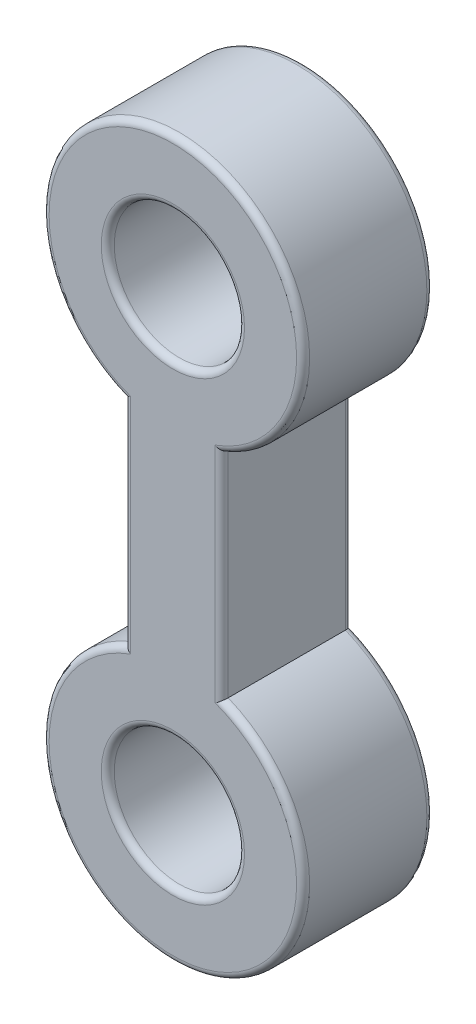
ISO-10303-21;
HEADER;
FILE_DESCRIPTION(('STEP AP214'),'2;1');
FILE_NAME('part.step','',(''),(''),'','','');
FILE_SCHEMA(('AUTOMOTIVE_DESIGN { 1 0 10303 214 1 1 1 1 }'));
ENDSEC;
DATA;
#1=APPLICATION_CONTEXT('core data for automotive mechanical design processes');
#2=APPLICATION_PROTOCOL_DEFINITION('international standard','automotive_design',2000,#1);
#3=PRODUCT_CONTEXT('',#1,'mechanical');
#4=PRODUCT('Part','Part','',(#3));
#5=PRODUCT_RELATED_PRODUCT_CATEGORY('part','',(#4));
#6=PRODUCT_DEFINITION_FORMATION('','',#4);
#7=PRODUCT_DEFINITION_CONTEXT('part definition',#1,'design');
#8=PRODUCT_DEFINITION('design','',#6,#7);
#9=PRODUCT_DEFINITION_SHAPE('','',#8);
#10=(LENGTH_UNIT() NAMED_UNIT(*) SI_UNIT(.MILLI.,.METRE.));
#11=(NAMED_UNIT(*) PLANE_ANGLE_UNIT() SI_UNIT($,.RADIAN.));
#12=(NAMED_UNIT(*) SI_UNIT($,.STERADIAN.) SOLID_ANGLE_UNIT());
#13=UNCERTAINTY_MEASURE_WITH_UNIT(LENGTH_MEASURE(1.E-05),#10,'distance_accuracy_value','');
#14=(GEOMETRIC_REPRESENTATION_CONTEXT(3) GLOBAL_UNCERTAINTY_ASSIGNED_CONTEXT((#13)) GLOBAL_UNIT_ASSIGNED_CONTEXT((#10,
#11,#12)) REPRESENTATION_CONTEXT('',''));
#15=CARTESIAN_POINT('',(0.,0.,0.));
#16=DIRECTION('',(0.,0.,1.));
#17=DIRECTION('',(1.,0.,0.));
#18=AXIS2_PLACEMENT_3D('',#15,#16,#17);
#19=CARTESIAN_POINT('',(0.,0.,10.));
#20=DIRECTION('',(0.,0.,1.));
#21=DIRECTION('',(1.,0.,0.));
#22=AXIS2_PLACEMENT_3D('',#19,#20,#21);
#23=PLANE('',#22);
#24=CARTESIAN_POINT('',(0.,-70.,10.));
#25=DIRECTION('',(0.,0.,1.));
#26=DIRECTION('',(1.,0.,0.));
#27=AXIS2_PLACEMENT_3D('',#24,#25,#26);
#28=CIRCLE('',#27,11.);
#29=CARTESIAN_POINT('',(11.,-70.,10.));
#30=VERTEX_POINT('',#29);
#31=EDGE_CURVE('E11',#30,#30,#28,.F.);
#32=ORIENTED_EDGE('',*,*,#31,.T.);
#33=EDGE_LOOP('',(#32));
#34=FACE_BOUND('',#33,.T.);
#35=CARTESIAN_POINT('',(0.,-70.,10.));
#36=DIRECTION('',(0.,0.,1.));
#37=DIRECTION('',(1.,0.,0.));
#38=AXIS2_PLACEMENT_3D('',#35,#36,#37);
#39=CIRCLE('',#38,19.);
#40=CARTESIAN_POINT('',(-6.49999999999999,-52.1464289286429,10.));
#41=VERTEX_POINT('',#40);
#42=CARTESIAN_POINT('',(6.50000000000001,-52.1464289286429,10.));
#43=VERTEX_POINT('',#42);
#44=EDGE_CURVE('E55',#41,#43,#39,.T.);
#45=ORIENTED_EDGE('',*,*,#44,.T.);
#46=DIRECTION('',(0.,1.,0.));
#47=VECTOR('',#46,1.);
#48=CARTESIAN_POINT('',(6.5,-18.5404962177392,10.));
#49=LINE('',#48,#47);
#50=CARTESIAN_POINT('',(6.5,-17.8535710713571,10.));
#51=VERTEX_POINT('',#50);
#52=EDGE_CURVE('E47',#43,#51,#49,.T.);
#53=ORIENTED_EDGE('',*,*,#52,.T.);
#54=CARTESIAN_POINT('',(0.,0.,10.));
#55=DIRECTION('',(0.,0.,1.));
#56=DIRECTION('',(1.,0.,0.));
#57=AXIS2_PLACEMENT_3D('',#54,#55,#56);
#58=CIRCLE('',#57,19.);
#59=CARTESIAN_POINT('',(-6.5,-17.8535710713571,10.));
#60=VERTEX_POINT('',#59);
#61=EDGE_CURVE('E173',#51,#60,#58,.T.);
#62=ORIENTED_EDGE('',*,*,#61,.T.);
#63=DIRECTION('',(0.,-1.,0.));
#64=VECTOR('',#63,1.);
#65=CARTESIAN_POINT('',(-6.49999999999999,-51.4595037822608,10.));
#66=LINE('',#65,#64);
#67=EDGE_CURVE('E60',#60,#41,#66,.T.);
#68=ORIENTED_EDGE('',*,*,#67,.T.);
#69=EDGE_LOOP('',(#45,#53,#62,#68));
#70=FACE_BOUND('',#69,.T.);
#71=CARTESIAN_POINT('',(0.,0.,10.));
#72=DIRECTION('',(0.,0.,1.));
#73=DIRECTION('',(1.,0.,0.));
#74=AXIS2_PLACEMENT_3D('',#71,#72,#73);
#75=CIRCLE('',#74,11.);
#76=CARTESIAN_POINT('',(11.,0.,10.));
#77=VERTEX_POINT('',#76);
#78=EDGE_CURVE('E170',#77,#77,#75,.F.);
#79=ORIENTED_EDGE('',*,*,#78,.T.);
#80=EDGE_LOOP('',(#79));
#81=FACE_BOUND('',#80,.T.);
#82=ADVANCED_FACE('F33',(#34,#70,#81),#23,.T.);
#83=CARTESIAN_POINT('',(0.,0.,-10.));
#84=DIRECTION('',(0.,0.,1.));
#85=DIRECTION('',(1.,0.,0.));
#86=AXIS2_PLACEMENT_3D('',#83,#84,#85);
#87=PLANE('',#86);
#88=CARTESIAN_POINT('',(0.,-70.,-10.));
#89=DIRECTION('',(0.,0.,1.));
#90=DIRECTION('',(1.,0.,0.));
#91=AXIS2_PLACEMENT_3D('',#88,#89,#90);
#92=CIRCLE('',#91,11.);
#93=CARTESIAN_POINT('',(11.,-70.,-10.));
#94=VERTEX_POINT('',#93);
#95=EDGE_CURVE('E135',#94,#94,#92,.T.);
#96=ORIENTED_EDGE('',*,*,#95,.T.);
#97=EDGE_LOOP('',(#96));
#98=FACE_BOUND('',#97,.T.);
#99=CARTESIAN_POINT('',(0.,0.,-10.));
#100=DIRECTION('',(0.,0.,1.));
#101=DIRECTION('',(1.,0.,0.));
#102=AXIS2_PLACEMENT_3D('',#99,#100,#101);
#103=CIRCLE('',#102,11.);
#104=CARTESIAN_POINT('',(11.,0.,-10.));
#105=VERTEX_POINT('',#104);
#106=EDGE_CURVE('E132',#105,#105,#103,.T.);
#107=ORIENTED_EDGE('',*,*,#106,.T.);
#108=EDGE_LOOP('',(#107));
#109=FACE_BOUND('',#108,.T.);
#110=CARTESIAN_POINT('',(0.,-70.,-10.));
#111=DIRECTION('',(0.,0.,1.));
#112=DIRECTION('',(1.,0.,0.));
#113=AXIS2_PLACEMENT_3D('',#110,#111,#112);
#114=CIRCLE('',#113,19.);
#115=CARTESIAN_POINT('',(6.50000000000001,-52.1464289286429,-10.));
#116=VERTEX_POINT('',#115);
#117=CARTESIAN_POINT('',(-6.49999999999999,-52.1464289286429,-10.));
#118=VERTEX_POINT('',#117);
#119=EDGE_CURVE('E131',#116,#118,#114,.F.);
#120=ORIENTED_EDGE('',*,*,#119,.T.);
#121=DIRECTION('',(0.,-1.,0.));
#122=VECTOR('',#121,1.);
#123=CARTESIAN_POINT('',(-6.5,0.,-10.));
#124=LINE('',#123,#122);
#125=CARTESIAN_POINT('',(-6.5,-17.8535710713571,-10.));
#126=VERTEX_POINT('',#125);
#127=EDGE_CURVE('E110',#118,#126,#124,.F.);
#128=ORIENTED_EDGE('',*,*,#127,.T.);
#129=CARTESIAN_POINT('',(0.,0.,-10.));
#130=DIRECTION('',(0.,0.,1.));
#131=DIRECTION('',(1.,0.,0.));
#132=AXIS2_PLACEMENT_3D('',#129,#130,#131);
#133=CIRCLE('',#132,19.);
#134=CARTESIAN_POINT('',(6.5,-17.8535710713571,-10.));
#135=VERTEX_POINT('',#134);
#136=EDGE_CURVE('E120',#126,#135,#133,.F.);
#137=ORIENTED_EDGE('',*,*,#136,.T.);
#138=DIRECTION('',(0.,1.,0.));
#139=VECTOR('',#138,1.);
#140=CARTESIAN_POINT('',(6.5,0.,-10.));
#141=LINE('',#140,#139);
#142=EDGE_CURVE('E126',#135,#116,#141,.F.);
#143=ORIENTED_EDGE('',*,*,#142,.T.);
#144=EDGE_LOOP('',(#120,#128,#137,#143));
#145=FACE_BOUND('',#144,.T.);
#146=ADVANCED_FACE('F129',(#98,#109,#145),#87,.F.);
#147=CARTESIAN_POINT('',(0.,0.,10.));
#148=DIRECTION('',(0.,0.,-1.));
#149=DIRECTION('',(-1.,0.,0.));
#150=AXIS2_PLACEMENT_3D('',#147,#148,#149);
#151=CYLINDRICAL_SURFACE('',#150,20.);
#152=DIRECTION('',(0.,0.,-1.));
#153=VECTOR('',#152,1.);
#154=CARTESIAN_POINT('',(7.5,-18.5404962177392,10.));
#155=LINE('',#154,#153);
#156=CARTESIAN_POINT('',(7.5,-18.5404962177392,9.));
#157=VERTEX_POINT('',#156);
#158=CARTESIAN_POINT('',(7.5,-18.5404962177392,-9.));
#159=VERTEX_POINT('',#158);
#160=EDGE_CURVE('E326',#157,#159,#155,.T.);
#161=ORIENTED_EDGE('',*,*,#160,.T.);
#162=CARTESIAN_POINT('',(0.,0.,-9.));
#163=DIRECTION('',(0.,0.,1.));
#164=DIRECTION('',(1.,0.,0.));
#165=AXIS2_PLACEMENT_3D('',#162,#163,#164);
#166=CIRCLE('',#165,20.);
#167=CARTESIAN_POINT('',(-7.5,-18.5404962177392,-9.));
#168=VERTEX_POINT('',#167);
#169=EDGE_CURVE('E168',#159,#168,#166,.T.);
#170=ORIENTED_EDGE('',*,*,#169,.T.);
#171=DIRECTION('',(0.,0.,-1.));
#172=VECTOR('',#171,1.);
#173=CARTESIAN_POINT('',(-7.5,-18.5404962177392,10.));
#174=LINE('',#173,#172);
#175=CARTESIAN_POINT('',(-7.5,-18.5404962177392,9.));
#176=VERTEX_POINT('',#175);
#177=EDGE_CURVE('E127',#176,#168,#174,.T.);
#178=ORIENTED_EDGE('',*,*,#177,.F.);
#179=CARTESIAN_POINT('',(0.,0.,9.));
#180=DIRECTION('',(0.,0.,1.));
#181=DIRECTION('',(1.,0.,0.));
#182=AXIS2_PLACEMENT_3D('',#179,#180,#181);
#183=CIRCLE('',#182,20.);
#184=EDGE_CURVE('E166',#176,#157,#183,.F.);
#185=ORIENTED_EDGE('',*,*,#184,.T.);
#186=EDGE_LOOP('',(#161,#170,#178,#185));
#187=FACE_BOUND('',#186,.T.);
#188=ADVANCED_FACE('F265',(#187),#151,.T.);
#189=CARTESIAN_POINT('',(-7.5,-18.5404962177392,10.));
#190=DIRECTION('',(1.,0.,0.));
#191=DIRECTION('',(0.,1.,0.));
#192=AXIS2_PLACEMENT_3D('',#189,#190,#191);
#193=PLANE('',#192);
#194=ORIENTED_EDGE('',*,*,#177,.T.);
#195=DIRECTION('',(0.,-1.,0.));
#196=VECTOR('',#195,1.);
#197=CARTESIAN_POINT('',(-7.5,-18.5404962177392,-9.));
#198=LINE('',#197,#196);
#199=CARTESIAN_POINT('',(-7.49999999999999,-51.4595037822608,-9.));
#200=VERTEX_POINT('',#199);
#201=EDGE_CURVE('E113',#168,#200,#198,.T.);
#202=ORIENTED_EDGE('',*,*,#201,.T.);
#203=DIRECTION('',(0.,0.,-1.));
#204=VECTOR('',#203,1.);
#205=CARTESIAN_POINT('',(-7.49999999999999,-51.4595037822608,10.));
#206=LINE('',#205,#204);
#207=CARTESIAN_POINT('',(-7.49999999999999,-51.4595037822608,9.));
#208=VERTEX_POINT('',#207);
#209=EDGE_CURVE('E328',#208,#200,#206,.T.);
#210=ORIENTED_EDGE('',*,*,#209,.F.);
#211=DIRECTION('',(0.,-1.,0.));
#212=VECTOR('',#211,1.);
#213=CARTESIAN_POINT('',(-7.5,-18.5404962177392,9.));
#214=LINE('',#213,#212);
#215=EDGE_CURVE('E154',#208,#176,#214,.F.);
#216=ORIENTED_EDGE('',*,*,#215,.T.);
#217=EDGE_LOOP('',(#194,#202,#210,#216));
#218=FACE_BOUND('',#217,.T.);
#219=ADVANCED_FACE('F279',(#218),#193,.F.);
#220=CARTESIAN_POINT('',(0.,-70.,10.));
#221=DIRECTION('',(0.,0.,-1.));
#222=DIRECTION('',(-1.,0.,0.));
#223=AXIS2_PLACEMENT_3D('',#220,#221,#222);
#224=CYLINDRICAL_SURFACE('',#223,20.);
#225=ORIENTED_EDGE('',*,*,#209,.T.);
#226=CARTESIAN_POINT('',(0.,-70.,-9.));
#227=DIRECTION('',(0.,0.,1.));
#228=DIRECTION('',(1.,0.,0.));
#229=AXIS2_PLACEMENT_3D('',#226,#227,#228);
#230=CIRCLE('',#229,20.);
#231=CARTESIAN_POINT('',(7.50000000000001,-51.4595037822608,-9.));
#232=VERTEX_POINT('',#231);
#233=EDGE_CURVE('E159',#200,#232,#230,.T.);
#234=ORIENTED_EDGE('',*,*,#233,.T.);
#235=DIRECTION('',(0.,0.,-1.));
#236=VECTOR('',#235,1.);
#237=CARTESIAN_POINT('',(7.50000000000001,-51.4595037822608,10.));
#238=LINE('',#237,#236);
#239=CARTESIAN_POINT('',(7.50000000000001,-51.4595037822608,9.));
#240=VERTEX_POINT('',#239);
#241=EDGE_CURVE('E323',#240,#232,#238,.T.);
#242=ORIENTED_EDGE('',*,*,#241,.F.);
#243=CARTESIAN_POINT('',(0.,-70.,9.));
#244=DIRECTION('',(0.,0.,1.));
#245=DIRECTION('',(1.,0.,0.));
#246=AXIS2_PLACEMENT_3D('',#243,#244,#245);
#247=CIRCLE('',#246,20.);
#248=EDGE_CURVE('E157',#240,#208,#247,.F.);
#249=ORIENTED_EDGE('',*,*,#248,.T.);
#250=EDGE_LOOP('',(#225,#234,#242,#249));
#251=FACE_BOUND('',#250,.T.);
#252=ADVANCED_FACE('F275',(#251),#224,.T.);
#253=CARTESIAN_POINT('',(7.5,-18.5404962177392,10.));
#254=DIRECTION('',(-1.,0.,0.));
#255=DIRECTION('',(0.,-1.,0.));
#256=AXIS2_PLACEMENT_3D('',#253,#254,#255);
#257=PLANE('',#256);
#258=ORIENTED_EDGE('',*,*,#241,.T.);
#259=DIRECTION('',(0.,1.,0.));
#260=VECTOR('',#259,1.);
#261=CARTESIAN_POINT('',(7.5,-18.5404962177392,-9.));
#262=LINE('',#261,#260);
#263=EDGE_CURVE('E164',#232,#159,#262,.T.);
#264=ORIENTED_EDGE('',*,*,#263,.T.);
#265=ORIENTED_EDGE('',*,*,#160,.F.);
#266=DIRECTION('',(0.,1.,0.));
#267=VECTOR('',#266,1.);
#268=CARTESIAN_POINT('',(7.50000000000001,-51.4595037822608,9.));
#269=LINE('',#268,#267);
#270=EDGE_CURVE('E161',#157,#240,#269,.F.);
#271=ORIENTED_EDGE('',*,*,#270,.T.);
#272=EDGE_LOOP('',(#258,#264,#265,#271));
#273=FACE_BOUND('',#272,.T.);
#274=ADVANCED_FACE('F272',(#273),#257,.F.);
#275=CARTESIAN_POINT('',(0.,0.,10.));
#276=DIRECTION('',(0.,0.,-1.));
#277=DIRECTION('',(-1.,0.,0.));
#278=AXIS2_PLACEMENT_3D('',#275,#276,#277);
#279=CYLINDRICAL_SURFACE('',#278,10.);
#280=CARTESIAN_POINT('',(0.,0.,-9.));
#281=DIRECTION('',(0.,0.,1.));
#282=DIRECTION('',(1.,0.,0.));
#283=AXIS2_PLACEMENT_3D('',#280,#281,#282);
#284=CIRCLE('',#283,10.);
#285=CARTESIAN_POINT('',(10.,0.,-9.));
#286=VERTEX_POINT('',#285);
#287=EDGE_CURVE('E151',#286,#286,#284,.F.);
#288=ORIENTED_EDGE('',*,*,#287,.T.);
#289=EDGE_LOOP('',(#288));
#290=FACE_BOUND('',#289,.T.);
#291=CARTESIAN_POINT('',(0.,0.,9.));
#292=DIRECTION('',(0.,0.,1.));
#293=DIRECTION('',(1.,0.,0.));
#294=AXIS2_PLACEMENT_3D('',#291,#292,#293);
#295=CIRCLE('',#294,10.);
#296=CARTESIAN_POINT('',(10.,0.,9.));
#297=VERTEX_POINT('',#296);
#298=EDGE_CURVE('E148',#297,#297,#295,.T.);
#299=ORIENTED_EDGE('',*,*,#298,.T.);
#300=EDGE_LOOP('',(#299));
#301=FACE_BOUND('',#300,.T.);
#302=ADVANCED_FACE('F269',(#290,#301),#279,.F.);
#303=CARTESIAN_POINT('',(0.,-70.,10.));
#304=DIRECTION('',(0.,0.,-1.));
#305=DIRECTION('',(-1.,0.,0.));
#306=AXIS2_PLACEMENT_3D('',#303,#304,#305);
#307=CYLINDRICAL_SURFACE('',#306,10.);
#308=CARTESIAN_POINT('',(0.,-70.,-9.));
#309=DIRECTION('',(0.,0.,1.));
#310=DIRECTION('',(1.,0.,0.));
#311=AXIS2_PLACEMENT_3D('',#308,#309,#310);
#312=CIRCLE('',#311,10.);
#313=CARTESIAN_POINT('',(10.,-70.,-9.));
#314=VERTEX_POINT('',#313);
#315=EDGE_CURVE('E145',#314,#314,#312,.F.);
#316=ORIENTED_EDGE('',*,*,#315,.T.);
#317=EDGE_LOOP('',(#316));
#318=FACE_BOUND('',#317,.T.);
#319=CARTESIAN_POINT('',(0.,-70.,9.));
#320=DIRECTION('',(0.,0.,1.));
#321=DIRECTION('',(1.,0.,0.));
#322=AXIS2_PLACEMENT_3D('',#319,#320,#321);
#323=CIRCLE('',#322,10.);
#324=CARTESIAN_POINT('',(10.,-70.,9.));
#325=VERTEX_POINT('',#324);
#326=EDGE_CURVE('E142',#325,#325,#323,.T.);
#327=ORIENTED_EDGE('',*,*,#326,.T.);
#328=EDGE_LOOP('',(#327));
#329=FACE_BOUND('',#328,.T.);
#330=ADVANCED_FACE('F289',(#318,#329),#307,.F.);
#331=CARTESIAN_POINT('',(0.,-70.,-9.));
#332=DIRECTION('',(0.,0.,1.));
#333=DIRECTION('',(1.,0.,0.));
#334=AXIS2_PLACEMENT_3D('',#331,#332,#333);
#335=TOROIDAL_SURFACE('',#334,11.,1.);
#336=ORIENTED_EDGE('',*,*,#315,.F.);
#337=EDGE_LOOP('',(#336));
#338=FACE_BOUND('',#337,.T.);
#339=ORIENTED_EDGE('',*,*,#95,.F.);
#340=EDGE_LOOP('',(#339));
#341=FACE_BOUND('',#340,.T.);
#342=ADVANCED_FACE('F287',(#338,#341),#335,.T.);
#343=CARTESIAN_POINT('',(0.,0.,-9.));
#344=DIRECTION('',(0.,0.,1.));
#345=DIRECTION('',(1.,0.,0.));
#346=AXIS2_PLACEMENT_3D('',#343,#344,#345);
#347=TOROIDAL_SURFACE('',#346,11.,1.);
#348=ORIENTED_EDGE('',*,*,#287,.F.);
#349=EDGE_LOOP('',(#348));
#350=FACE_BOUND('',#349,.T.);
#351=ORIENTED_EDGE('',*,*,#106,.F.);
#352=EDGE_LOOP('',(#351));
#353=FACE_BOUND('',#352,.T.);
#354=ADVANCED_FACE('F214',(#350,#353),#347,.T.);
#355=CARTESIAN_POINT('',(6.5,-18.5404962177392,-9.));
#356=DIRECTION('',(0.,1.,0.));
#357=DIRECTION('',(-1.,0.,0.));
#358=AXIS2_PLACEMENT_3D('',#355,#356,#357);
#359=CYLINDRICAL_SURFACE('',#358,1.);
#360=CARTESIAN_POINT('',(7.50000000000001,-51.4595037822608,-9.));
#361=CARTESIAN_POINT('',(7.5000018976937,-51.4595026043384,-9.02469557126901));
#362=CARTESIAN_POINT('',(7.49908446359424,-51.4601210271123,-9.04937783193884));
#363=CARTESIAN_POINT('',(7.49543833573052,-51.4625794492258,-9.09853701940789));
#364=CARTESIAN_POINT('',(7.49271038364174,-51.4644189483537,-9.12301402613303));
#365=CARTESIAN_POINT('',(7.48189376100379,-51.4717143578347,-9.19561058121729));
#366=CARTESIAN_POINT('',(7.47117157764479,-51.4789476645999,-9.24319343216988));
#367=CARTESIAN_POINT('',(7.44330371697541,-51.4977655453967,-9.33541207747412));
#368=CARTESIAN_POINT('',(7.42616581189549,-51.5093448545722,-9.38005136111824));
#369=CARTESIAN_POINT('',(7.38628330244707,-51.5363258219173,-9.46554204788778));
#370=CARTESIAN_POINT('',(7.36353264463759,-51.5517316071231,-9.50638929534488));
#371=CARTESIAN_POINT('',(7.3118063070115,-51.5868122556768,-9.58596941034456));
#372=CARTESIAN_POINT('',(7.28253378977325,-51.6066914315319,-9.62441765058433));
#373=CARTESIAN_POINT('',(7.21978477451096,-51.6493848773834,-9.69582434706756));
#374=CARTESIAN_POINT('',(7.18630749885936,-51.6721996903153,-9.72878178521296));
#375=CARTESIAN_POINT('',(7.11040415203343,-51.7240355166642,-9.79391148569648));
#376=CARTESIAN_POINT('',(7.06740673577812,-51.7534633186864,-9.82509293251835));
#377=CARTESIAN_POINT('',(6.97824901474556,-51.8146442306898,-9.87978362130725));
#378=CARTESIAN_POINT('',(6.93208430442952,-51.8464005839609,-9.90328190347743));
#379=CARTESIAN_POINT('',(6.82376706493336,-51.9211187082728,-9.94845139410932));
#380=CARTESIAN_POINT('',(6.76091166467115,-51.9646251240664,-9.96754419030609));
#381=CARTESIAN_POINT('',(6.63376141351095,-52.05296731462,-9.9931274266423));
#382=CARTESIAN_POINT('',(6.56946967618564,-52.0978002715304,-9.99964287098959));
#383=CARTESIAN_POINT('',(6.50356311398428,-52.1439343793164,-9.99999524228929));
#384=CARTESIAN_POINT('',(6.50178148239448,-52.1451816401532,-10.0000000029543));
#385=CARTESIAN_POINT('',(6.50000000000001,-52.1464289286429,-10.));
#386=B_SPLINE_CURVE_WITH_KNOTS('',3,(#360,#361,#362,#363,#364,#365,#366,#367,#368,#369,#370,
#371,#372,#373,#374,#375,#376,#377,#378,#379,#380,#381,#382,#383,#384,#385),.UNSPECIFIED.,.F.,
.F.,(4,2,2,2,2,2,2,2,2,2,2,2,4),(0.,0.0740361905573395,0.148042071024502,0.295173080104486,
0.442126423290589,0.589238956169167,0.745400938242295,0.901591843537982,1.08306771193246,
1.26480133198613,1.50008249081373,1.73489541893545,1.74141988969473),.UNSPECIFIED.);
#387=EDGE_CURVE('E116',#116,#232,#386,.F.);
#388=ORIENTED_EDGE('',*,*,#387,.F.);
#389=ORIENTED_EDGE('',*,*,#142,.F.);
#390=CARTESIAN_POINT('',(7.5,-18.5404962177392,-9.));
#391=CARTESIAN_POINT('',(7.5000018976937,-18.5404973956616,-9.02469557126901));
#392=CARTESIAN_POINT('',(7.49908446359424,-18.5398789728877,-9.04937783193884));
#393=CARTESIAN_POINT('',(7.49543833573051,-18.5374205507742,-9.09853701940789));
#394=CARTESIAN_POINT('',(7.49271038364174,-18.5355810516463,-9.12301402613303));
#395=CARTESIAN_POINT('',(7.48189376100379,-18.5282856421653,-9.19561058121729));
#396=CARTESIAN_POINT('',(7.47117157764479,-18.5210523354001,-9.24319343216988));
#397=CARTESIAN_POINT('',(7.44330371697541,-18.5022344546033,-9.33541207747412));
#398=CARTESIAN_POINT('',(7.42616581189548,-18.4906551454278,-9.38005136111824));
#399=CARTESIAN_POINT('',(7.38628330244706,-18.4636741780827,-9.46554204788778));
#400=CARTESIAN_POINT('',(7.36353264463758,-18.4482683928769,-9.50638929534488));
#401=CARTESIAN_POINT('',(7.3118063070115,-18.4131877443232,-9.58596941034456));
#402=CARTESIAN_POINT('',(7.28253378977325,-18.3933085684681,-9.62441765058433));
#403=CARTESIAN_POINT('',(7.21978477451096,-18.3506151226166,-9.69582434706756));
#404=CARTESIAN_POINT('',(7.18630749885936,-18.3278003096847,-9.72878178521296));
#405=CARTESIAN_POINT('',(7.11040415203343,-18.2759644833358,-9.79391148569648));
#406=CARTESIAN_POINT('',(7.06740673577811,-18.2465366813136,-9.82509293251835));
#407=CARTESIAN_POINT('',(6.97824901474555,-18.1853557693102,-9.87978362130725));
#408=CARTESIAN_POINT('',(6.93208430442951,-18.1535994160391,-9.90328190347743));
#409=CARTESIAN_POINT('',(6.82376706493336,-18.0788812917271,-9.94845139410932));
#410=CARTESIAN_POINT('',(6.76091166467116,-18.0353748759335,-9.96754419030609));
#411=CARTESIAN_POINT('',(6.63376141351094,-17.94703268538,-9.9931274266423));
#412=CARTESIAN_POINT('',(6.56946967618558,-17.9021997284696,-9.99964287098959));
#413=CARTESIAN_POINT('',(6.50356311398428,-17.8560656206836,-9.99999524228929));
#414=CARTESIAN_POINT('',(6.50178148239448,-17.8548183598468,-10.0000000029543));
#415=CARTESIAN_POINT('',(6.5,-17.8535710713571,-10.));
#416=B_SPLINE_CURVE_WITH_KNOTS('',3,(#390,#391,#392,#393,#394,#395,#396,#397,#398,#399,#400,
#401,#402,#403,#404,#405,#406,#407,#408,#409,#410,#411,#412,#413,#414,#415),.UNSPECIFIED.,.F.,
.F.,(4,2,2,2,2,2,2,2,2,2,2,2,4),(0.,0.0740361905573395,0.148042071024501,0.295173080104486,
0.442126423290588,0.589238956169167,0.745400938242295,0.901591843537985,1.08306771193246,
1.26480133198613,1.50008249081373,1.73489541893545,1.74141988969473),.UNSPECIFIED.);
#417=EDGE_CURVE('E123',#159,#135,#416,.T.);
#418=ORIENTED_EDGE('',*,*,#417,.F.);
#419=ORIENTED_EDGE('',*,*,#263,.F.);
#420=EDGE_LOOP('',(#388,#389,#418,#419));
#421=FACE_BOUND('',#420,.T.);
#422=ADVANCED_FACE('F210',(#421),#359,.T.);
#423=CARTESIAN_POINT('',(0.,0.,-9.));
#424=DIRECTION('',(0.,0.,1.));
#425=DIRECTION('',(1.,0.,0.));
#426=AXIS2_PLACEMENT_3D('',#423,#424,#425);
#427=TOROIDAL_SURFACE('',#426,19.,1.);
#428=ORIENTED_EDGE('',*,*,#417,.T.);
#429=ORIENTED_EDGE('',*,*,#136,.F.);
#430=CARTESIAN_POINT('',(-7.5,-18.5404962177392,-9.));
#431=CARTESIAN_POINT('',(-7.50000189769369,-18.5404973956616,-9.02469557126901));
#432=CARTESIAN_POINT('',(-7.49908446359423,-18.5398789728877,-9.04937783193884));
#433=CARTESIAN_POINT('',(-7.49543833573051,-18.5374205507742,-9.09853701940789));
#434=CARTESIAN_POINT('',(-7.49271038364173,-18.5355810516463,-9.12301402613303));
#435=CARTESIAN_POINT('',(-7.48189376100378,-18.5282856421653,-9.19561058121729));
#436=CARTESIAN_POINT('',(-7.47117157764478,-18.5210523354001,-9.24319343216988));
#437=CARTESIAN_POINT('',(-7.44330371697541,-18.5022344546033,-9.33541207747412));
#438=CARTESIAN_POINT('',(-7.42616581189548,-18.4906551454278,-9.38005136111824));
#439=CARTESIAN_POINT('',(-7.38628330244706,-18.4636741780827,-9.46554204788778));
#440=CARTESIAN_POINT('',(-7.36353264463758,-18.4482683928769,-9.50638929534488));
#441=CARTESIAN_POINT('',(-7.31180630701149,-18.4131877443232,-9.58596941034455));
#442=CARTESIAN_POINT('',(-7.28253378977324,-18.3933085684681,-9.62441765058433));
#443=CARTESIAN_POINT('',(-7.21978477451095,-18.3506151226166,-9.69582434706756));
#444=CARTESIAN_POINT('',(-7.18630749885936,-18.3278003096847,-9.72878178521296));
#445=CARTESIAN_POINT('',(-7.11040415203342,-18.2759644833358,-9.79391148569648));
#446=CARTESIAN_POINT('',(-7.06740673577811,-18.2465366813136,-9.82509293251835));
#447=CARTESIAN_POINT('',(-6.97824901474555,-18.1853557693102,-9.87978362130725));
#448=CARTESIAN_POINT('',(-6.93208430442951,-18.1535994160391,-9.90328190347744));
#449=CARTESIAN_POINT('',(-6.82376706493334,-18.0788812917272,-9.94845139410932));
#450=CARTESIAN_POINT('',(-6.76091166467111,-18.0353748759336,-9.96754419030609));
#451=CARTESIAN_POINT('',(-6.63376141351098,-17.94703268538,-9.9931274266423));
#452=CARTESIAN_POINT('',(-6.56946967618575,-17.9021997284694,-9.99964287098959));
#453=CARTESIAN_POINT('',(-6.50356311398428,-17.8560656206836,-9.99999524228929));
#454=CARTESIAN_POINT('',(-6.50178148239448,-17.8548183598468,-10.0000000029543));
#455=CARTESIAN_POINT('',(-6.5,-17.8535710713571,-10.));
#456=B_SPLINE_CURVE_WITH_KNOTS('',3,(#430,#431,#432,#433,#434,#435,#436,#437,#438,#439,#440,
#441,#442,#443,#444,#445,#446,#447,#448,#449,#450,#451,#452,#453,#454,#455),.UNSPECIFIED.,.F.,
.F.,(4,2,2,2,2,2,2,2,2,2,2,2,4),(0.,0.0740361905573395,0.148042071024502,0.295173080104485,
0.442126423290588,0.589238956169166,0.745400938242296,0.901591843537984,1.08306771193246,
1.26480133198613,1.50008249081373,1.73489541893545,1.74141988969472),.UNSPECIFIED.);
#457=EDGE_CURVE('E106',#168,#126,#456,.T.);
#458=ORIENTED_EDGE('',*,*,#457,.F.);
#459=ORIENTED_EDGE('',*,*,#169,.F.);
#460=EDGE_LOOP('',(#428,#429,#458,#459));
#461=FACE_BOUND('',#460,.T.);
#462=ADVANCED_FACE('F121',(#461),#427,.T.);
#463=CARTESIAN_POINT('',(0.,-70.,-9.));
#464=DIRECTION('',(0.,0.,1.));
#465=DIRECTION('',(1.,0.,0.));
#466=AXIS2_PLACEMENT_3D('',#463,#464,#465);
#467=TOROIDAL_SURFACE('',#466,19.,1.);
#468=ORIENTED_EDGE('',*,*,#387,.T.);
#469=ORIENTED_EDGE('',*,*,#233,.F.);
#470=CARTESIAN_POINT('',(-7.49999999999999,-51.4595037822608,-9.));
#471=CARTESIAN_POINT('',(-7.50000189769369,-51.4595026043384,-9.02469557126901));
#472=CARTESIAN_POINT('',(-7.49908446359423,-51.4601210271123,-9.04937783193884));
#473=CARTESIAN_POINT('',(-7.4954383357305,-51.4625794492258,-9.09853701940789));
#474=CARTESIAN_POINT('',(-7.49271038364173,-51.4644189483537,-9.12301402613303));
#475=CARTESIAN_POINT('',(-7.48189376100378,-51.4717143578347,-9.19561058121729));
#476=CARTESIAN_POINT('',(-7.47117157764478,-51.4789476645999,-9.24319343216988));
#477=CARTESIAN_POINT('',(-7.4433037169754,-51.4977655453967,-9.33541207747412));
#478=CARTESIAN_POINT('',(-7.42616581189548,-51.5093448545722,-9.38005136111824));
#479=CARTESIAN_POINT('',(-7.38628330244705,-51.5363258219173,-9.46554204788778));
#480=CARTESIAN_POINT('',(-7.36353264463757,-51.5517316071231,-9.50638929534488));
#481=CARTESIAN_POINT('',(-7.31180630701149,-51.5868122556768,-9.58596941034456));
#482=CARTESIAN_POINT('',(-7.28253378977324,-51.6066914315319,-9.62441765058433));
#483=CARTESIAN_POINT('',(-7.21978477451095,-51.6493848773834,-9.69582434706756));
#484=CARTESIAN_POINT('',(-7.18630749885935,-51.6721996903153,-9.72878178521296));
#485=CARTESIAN_POINT('',(-7.11040415203342,-51.7240355166642,-9.79391148569648));
#486=CARTESIAN_POINT('',(-7.06740673577811,-51.7534633186864,-9.82509293251835));
#487=CARTESIAN_POINT('',(-6.97824901474555,-51.8146442306898,-9.87978362130725));
#488=CARTESIAN_POINT('',(-6.9320843044295,-51.8464005839609,-9.90328190347744));
#489=CARTESIAN_POINT('',(-6.82376706493335,-51.9211187082728,-9.94845139410933));
#490=CARTESIAN_POINT('',(-6.76091166467116,-51.9646251240665,-9.96754419030609));
#491=CARTESIAN_POINT('',(-6.63376141351092,-52.0529673146199,-9.9931274266423));
#492=CARTESIAN_POINT('',(-6.56946967618555,-52.0978002715303,-9.99964287098959));
#493=CARTESIAN_POINT('',(-6.50356311398426,-52.1439343793164,-9.99999524228929));
#494=CARTESIAN_POINT('',(-6.50178148239447,-52.1451816401532,-10.0000000029543));
#495=CARTESIAN_POINT('',(-6.49999999999999,-52.1464289286429,-10.));
#496=B_SPLINE_CURVE_WITH_KNOTS('',3,(#470,#471,#472,#473,#474,#475,#476,#477,#478,#479,#480,
#481,#482,#483,#484,#485,#486,#487,#488,#489,#490,#491,#492,#493,#494,#495),.UNSPECIFIED.,.F.,
.F.,(4,2,2,2,2,2,2,2,2,2,2,2,4),(0.,0.0740361905573393,0.148042071024502,0.295173080104486,
0.442126423290588,0.589238956169166,0.745400938242295,0.90159184353798,1.08306771193246,
1.26480133198613,1.50008249081373,1.73489541893546,1.74141988969472),.UNSPECIFIED.);
#497=EDGE_CURVE('E117',#118,#200,#496,.F.);
#498=ORIENTED_EDGE('',*,*,#497,.F.);
#499=ORIENTED_EDGE('',*,*,#119,.F.);
#500=EDGE_LOOP('',(#468,#469,#498,#499));
#501=FACE_BOUND('',#500,.T.);
#502=ADVANCED_FACE('F192',(#501),#467,.T.);
#503=CARTESIAN_POINT('',(-6.5,-18.5404962177392,-9.));
#504=DIRECTION('',(0.,-1.,0.));
#505=DIRECTION('',(1.,0.,0.));
#506=AXIS2_PLACEMENT_3D('',#503,#504,#505);
#507=CYLINDRICAL_SURFACE('',#506,1.);
#508=ORIENTED_EDGE('',*,*,#457,.T.);
#509=ORIENTED_EDGE('',*,*,#127,.F.);
#510=ORIENTED_EDGE('',*,*,#497,.T.);
#511=ORIENTED_EDGE('',*,*,#201,.F.);
#512=EDGE_LOOP('',(#508,#509,#510,#511));
#513=FACE_BOUND('',#512,.T.);
#514=ADVANCED_FACE('F108',(#513),#507,.T.);
#515=CARTESIAN_POINT('',(0.,-70.,9.));
#516=DIRECTION('',(0.,0.,1.));
#517=DIRECTION('',(1.,0.,0.));
#518=AXIS2_PLACEMENT_3D('',#515,#516,#517);
#519=TOROIDAL_SURFACE('',#518,11.,1.);
#520=ORIENTED_EDGE('',*,*,#31,.F.);
#521=EDGE_LOOP('',(#520));
#522=FACE_BOUND('',#521,.T.);
#523=ORIENTED_EDGE('',*,*,#326,.F.);
#524=EDGE_LOOP('',(#523));
#525=FACE_BOUND('',#524,.T.);
#526=ADVANCED_FACE('F216',(#522,#525),#519,.T.);
#527=CARTESIAN_POINT('',(-6.5,0.,9.));
#528=DIRECTION('',(0.,1.,0.));
#529=DIRECTION('',(-1.,0.,0.));
#530=AXIS2_PLACEMENT_3D('',#527,#528,#529);
#531=CYLINDRICAL_SURFACE('',#530,1.);
#532=CARTESIAN_POINT('',(-7.5,-18.5404962177392,9.));
#533=CARTESIAN_POINT('',(-7.50000189769369,-18.5404973956616,9.02469557126901));
#534=CARTESIAN_POINT('',(-7.49908446359423,-18.5398789728877,9.04937783193884));
#535=CARTESIAN_POINT('',(-7.49543833573051,-18.5374205507742,9.09853701940789));
#536=CARTESIAN_POINT('',(-7.49271038364173,-18.5355810516463,9.12301402613303));
#537=CARTESIAN_POINT('',(-7.48189376100378,-18.5282856421653,9.19561058121729));
#538=CARTESIAN_POINT('',(-7.47117157764478,-18.5210523354001,9.24319343216988));
#539=CARTESIAN_POINT('',(-7.4433037169754,-18.5022344546033,9.33541207747412));
#540=CARTESIAN_POINT('',(-7.42616581189548,-18.4906551454278,9.38005136111823));
#541=CARTESIAN_POINT('',(-7.38628330244706,-18.4636741780827,9.46554204788778));
#542=CARTESIAN_POINT('',(-7.36353264463758,-18.4482683928769,9.50638929534488));
#543=CARTESIAN_POINT('',(-7.31180630701149,-18.4131877443232,9.58596941034455));
#544=CARTESIAN_POINT('',(-7.28253378977324,-18.3933085684681,9.62441765058433));
#545=CARTESIAN_POINT('',(-7.21978477451095,-18.3506151226166,9.69582434706756));
#546=CARTESIAN_POINT('',(-7.18630749885935,-18.3278003096847,9.72878178521296));
#547=CARTESIAN_POINT('',(-7.11040415203342,-18.2759644833358,9.79391148569647));
#548=CARTESIAN_POINT('',(-7.06740673577811,-18.2465366813136,9.82509293251835));
#549=CARTESIAN_POINT('',(-6.97824901474555,-18.1853557693102,9.87978362130725));
#550=CARTESIAN_POINT('',(-6.93208430442951,-18.1535994160391,9.90328190347744));
#551=CARTESIAN_POINT('',(-6.82376706493334,-18.0788812917272,9.94845139410932));
#552=CARTESIAN_POINT('',(-6.76091166467111,-18.0353748759336,9.96754419030609));
#553=CARTESIAN_POINT('',(-6.63376141351098,-17.94703268538,9.9931274266423));
#554=CARTESIAN_POINT('',(-6.56946967618576,-17.9021997284694,9.99964287098958));
#555=CARTESIAN_POINT('',(-6.50356311398428,-17.8560656206836,9.99999524228929));
#556=CARTESIAN_POINT('',(-6.50178148239448,-17.8548183598468,10.0000000029543));
#557=CARTESIAN_POINT('',(-6.5,-17.8535710713571,10.));
#558=B_SPLINE_CURVE_WITH_KNOTS('',3,(#532,#533,#534,#535,#536,#537,#538,#539,#540,#541,#542,
#543,#544,#545,#546,#547,#548,#549,#550,#551,#552,#553,#554,#555,#556,#557),.UNSPECIFIED.,.F.,
.F.,(4,2,2,2,2,2,2,2,2,2,2,2,4),(0.,0.0740361905573395,0.148042071024502,0.295173080104486,
0.442126423290589,0.589238956169167,0.745400938242298,0.901591843537985,1.08306771193246,
1.26480133198613,1.50008249081372,1.73489541893545,1.74141988969472),.UNSPECIFIED.);
#559=EDGE_CURVE('E237',#176,#60,#558,.T.);
#560=ORIENTED_EDGE('',*,*,#559,.F.);
#561=ORIENTED_EDGE('',*,*,#215,.F.);
#562=CARTESIAN_POINT('',(-7.49999999999999,-51.4595037822608,9.));
#563=CARTESIAN_POINT('',(-7.50000189769369,-51.4595026043384,9.02469557126901));
#564=CARTESIAN_POINT('',(-7.49908446359423,-51.4601210271123,9.04937783193884));
#565=CARTESIAN_POINT('',(-7.4954383357305,-51.4625794492258,9.09853701940789));
#566=CARTESIAN_POINT('',(-7.49271038364173,-51.4644189483537,9.12301402613303));
#567=CARTESIAN_POINT('',(-7.48189376100378,-51.4717143578347,9.19561058121729));
#568=CARTESIAN_POINT('',(-7.47117157764478,-51.4789476645999,9.24319343216988));
#569=CARTESIAN_POINT('',(-7.4433037169754,-51.4977655453967,9.33541207747411));
#570=CARTESIAN_POINT('',(-7.42616581189548,-51.5093448545722,9.38005136111823));
#571=CARTESIAN_POINT('',(-7.38628330244705,-51.5363258219173,9.46554204788778));
#572=CARTESIAN_POINT('',(-7.36353264463757,-51.5517316071231,9.50638929534488));
#573=CARTESIAN_POINT('',(-7.31180630701149,-51.5868122556768,9.58596941034456));
#574=CARTESIAN_POINT('',(-7.28253378977324,-51.6066914315319,9.62441765058433));
#575=CARTESIAN_POINT('',(-7.21978477451095,-51.6493848773834,9.69582434706756));
#576=CARTESIAN_POINT('',(-7.18630749885935,-51.6721996903153,9.72878178521295));
#577=CARTESIAN_POINT('',(-7.11040415203342,-51.7240355166642,9.79391148569647));
#578=CARTESIAN_POINT('',(-7.06740673577811,-51.7534633186864,9.82509293251835));
#579=CARTESIAN_POINT('',(-6.97824901474554,-51.8146442306898,9.87978362130725));
#580=CARTESIAN_POINT('',(-6.9320843044295,-51.8464005839609,9.90328190347744));
#581=CARTESIAN_POINT('',(-6.82376706493335,-51.9211187082728,9.94845139410932));
#582=CARTESIAN_POINT('',(-6.76091166467116,-51.9646251240665,9.96754419030609));
#583=CARTESIAN_POINT('',(-6.63376141351092,-52.0529673146199,9.9931274266423));
#584=CARTESIAN_POINT('',(-6.56946967618555,-52.0978002715303,9.99964287098958));
#585=CARTESIAN_POINT('',(-6.50356311398426,-52.1439343793164,9.99999524228929));
#586=CARTESIAN_POINT('',(-6.50178148239446,-52.1451816401532,10.0000000029543));
#587=CARTESIAN_POINT('',(-6.49999999999999,-52.1464289286429,10.));
#588=B_SPLINE_CURVE_WITH_KNOTS('',3,(#562,#563,#564,#565,#566,#567,#568,#569,#570,#571,#572,
#573,#574,#575,#576,#577,#578,#579,#580,#581,#582,#583,#584,#585,#586,#587),.UNSPECIFIED.,.F.,
.F.,(4,2,2,2,2,2,2,2,2,2,2,2,4),(0.,0.0740361905573393,0.148042071024502,0.295173080104486,
0.442126423290588,0.589238956169167,0.745400938242301,0.90159184353798,1.08306771193247,
1.26480133198613,1.50008249081373,1.73489541893546,1.74141988969473),.UNSPECIFIED.);
#589=EDGE_CURVE('E37',#41,#208,#588,.F.);
#590=ORIENTED_EDGE('',*,*,#589,.F.);
#591=ORIENTED_EDGE('',*,*,#67,.F.);
#592=EDGE_LOOP('',(#560,#561,#590,#591));
#593=FACE_BOUND('',#592,.T.);
#594=ADVANCED_FACE('F220',(#593),#531,.T.);
#595=CARTESIAN_POINT('',(0.,-70.,9.));
#596=DIRECTION('',(0.,0.,1.));
#597=DIRECTION('',(1.,0.,0.));
#598=AXIS2_PLACEMENT_3D('',#595,#596,#597);
#599=TOROIDAL_SURFACE('',#598,19.,1.);
#600=ORIENTED_EDGE('',*,*,#589,.T.);
#601=ORIENTED_EDGE('',*,*,#248,.F.);
#602=CARTESIAN_POINT('',(7.50000000000001,-51.4595037822608,9.));
#603=CARTESIAN_POINT('',(7.5000018976937,-51.4595026043384,9.02469557126901));
#604=CARTESIAN_POINT('',(7.49908446359424,-51.4601210271123,9.04937783193884));
#605=CARTESIAN_POINT('',(7.49543833573052,-51.4625794492258,9.09853701940789));
#606=CARTESIAN_POINT('',(7.49271038364174,-51.4644189483537,9.12301402613303));
#607=CARTESIAN_POINT('',(7.48189376100379,-51.4717143578347,9.19561058121729));
#608=CARTESIAN_POINT('',(7.47117157764479,-51.4789476645999,9.24319343216988));
#609=CARTESIAN_POINT('',(7.44330371697541,-51.4977655453967,9.33541207747411));
#610=CARTESIAN_POINT('',(7.42616581189549,-51.5093448545722,9.38005136111823));
#611=CARTESIAN_POINT('',(7.38628330244707,-51.5363258219173,9.46554204788777));
#612=CARTESIAN_POINT('',(7.36353264463759,-51.5517316071231,9.50638929534488));
#613=CARTESIAN_POINT('',(7.3118063070115,-51.5868122556768,9.58596941034455));
#614=CARTESIAN_POINT('',(7.28253378977325,-51.6066914315319,9.62441765058433));
#615=CARTESIAN_POINT('',(7.21978477451096,-51.6493848773834,9.69582434706756));
#616=CARTESIAN_POINT('',(7.18630749885937,-51.6721996903153,9.72878178521296));
#617=CARTESIAN_POINT('',(7.11040415203343,-51.7240355166642,9.79391148569647));
#618=CARTESIAN_POINT('',(7.06740673577812,-51.7534633186864,9.82509293251835));
#619=CARTESIAN_POINT('',(6.97824901474556,-51.8146442306898,9.87978362130724));
#620=CARTESIAN_POINT('',(6.93208430442952,-51.8464005839609,9.90328190347743));
#621=CARTESIAN_POINT('',(6.82376706493336,-51.9211187082728,9.94845139410932));
#622=CARTESIAN_POINT('',(6.76091166467115,-51.9646251240664,9.96754419030609));
#623=CARTESIAN_POINT('',(6.63376141351095,-52.05296731462,9.9931274266423));
#624=CARTESIAN_POINT('',(6.56946967618564,-52.0978002715304,9.99964287098958));
#625=CARTESIAN_POINT('',(6.50356311398428,-52.1439343793164,9.99999524228929));
#626=CARTESIAN_POINT('',(6.50178148239448,-52.1451816401532,10.0000000029543));
#627=CARTESIAN_POINT('',(6.50000000000001,-52.1464289286429,10.));
#628=B_SPLINE_CURVE_WITH_KNOTS('',3,(#602,#603,#604,#605,#606,#607,#608,#609,#610,#611,#612,
#613,#614,#615,#616,#617,#618,#619,#620,#621,#622,#623,#624,#625,#626,#627),.UNSPECIFIED.,.F.,
.F.,(4,2,2,2,2,2,2,2,2,2,2,2,4),(0.,0.0740361905573395,0.148042071024502,0.295173080104486,
0.442126423290587,0.589238956169166,0.745400938242295,0.901591843537982,1.08306771193246,
1.26480133198613,1.50008249081373,1.73489541893545,1.74141988969473),.UNSPECIFIED.);
#629=EDGE_CURVE('E243',#43,#240,#628,.F.);
#630=ORIENTED_EDGE('',*,*,#629,.F.);
#631=ORIENTED_EDGE('',*,*,#44,.F.);
#632=EDGE_LOOP('',(#600,#601,#630,#631));
#633=FACE_BOUND('',#632,.T.);
#634=ADVANCED_FACE('F227',(#633),#599,.T.);
#635=CARTESIAN_POINT('',(0.,0.,9.));
#636=DIRECTION('',(0.,0.,1.));
#637=DIRECTION('',(1.,0.,0.));
#638=AXIS2_PLACEMENT_3D('',#635,#636,#637);
#639=TOROIDAL_SURFACE('',#638,19.,1.);
#640=ORIENTED_EDGE('',*,*,#559,.T.);
#641=ORIENTED_EDGE('',*,*,#61,.F.);
#642=CARTESIAN_POINT('',(7.5,-18.5404962177392,9.));
#643=CARTESIAN_POINT('',(7.5000018976937,-18.5404973956616,9.02469557126901));
#644=CARTESIAN_POINT('',(7.49908446359424,-18.5398789728877,9.04937783193884));
#645=CARTESIAN_POINT('',(7.49543833573051,-18.5374205507742,9.09853701940789));
#646=CARTESIAN_POINT('',(7.49271038364174,-18.5355810516463,9.12301402613303));
#647=CARTESIAN_POINT('',(7.48189376100379,-18.5282856421653,9.19561058121729));
#648=CARTESIAN_POINT('',(7.47117157764479,-18.5210523354001,9.24319343216988));
#649=CARTESIAN_POINT('',(7.44330371697541,-18.5022344546033,9.33541207747411));
#650=CARTESIAN_POINT('',(7.42616581189548,-18.4906551454278,9.38005136111823));
#651=CARTESIAN_POINT('',(7.38628330244706,-18.4636741780827,9.46554204788778));
#652=CARTESIAN_POINT('',(7.36353264463758,-18.4482683928769,9.50638929534488));
#653=CARTESIAN_POINT('',(7.3118063070115,-18.4131877443232,9.58596941034455));
#654=CARTESIAN_POINT('',(7.28253378977325,-18.3933085684681,9.62441765058433));
#655=CARTESIAN_POINT('',(7.21978477451096,-18.3506151226166,9.69582434706756));
#656=CARTESIAN_POINT('',(7.18630749885936,-18.3278003096847,9.72878178521296));
#657=CARTESIAN_POINT('',(7.11040415203343,-18.2759644833358,9.79391148569648));
#658=CARTESIAN_POINT('',(7.06740673577812,-18.2465366813136,9.82509293251835));
#659=CARTESIAN_POINT('',(6.97824901474555,-18.1853557693102,9.87978362130724));
#660=CARTESIAN_POINT('',(6.93208430442951,-18.1535994160391,9.90328190347743));
#661=CARTESIAN_POINT('',(6.82376706493336,-18.0788812917272,9.94845139410932));
#662=CARTESIAN_POINT('',(6.76091166467115,-18.0353748759335,9.96754419030609));
#663=CARTESIAN_POINT('',(6.63376141351094,-17.94703268538,9.9931274266423));
#664=CARTESIAN_POINT('',(6.56946967618561,-17.9021997284696,9.99964287098958));
#665=CARTESIAN_POINT('',(6.50356311398428,-17.8560656206836,9.99999524228929));
#666=CARTESIAN_POINT('',(6.50178148239448,-17.8548183598468,10.0000000029543));
#667=CARTESIAN_POINT('',(6.5,-17.8535710713571,10.));
#668=B_SPLINE_CURVE_WITH_KNOTS('',3,(#642,#643,#644,#645,#646,#647,#648,#649,#650,#651,#652,
#653,#654,#655,#656,#657,#658,#659,#660,#661,#662,#663,#664,#665,#666,#667),.UNSPECIFIED.,.F.,
.F.,(4,2,2,2,2,2,2,2,2,2,2,2,4),(0.,0.0740361905573395,0.148042071024501,0.295173080104486,
0.442126423290586,0.589238956169167,0.745400938242298,0.901591843537984,1.08306771193246,
1.26480133198613,1.50008249081373,1.73489541893545,1.74141988969473),.UNSPECIFIED.);
#669=EDGE_CURVE('E231',#157,#51,#668,.T.);
#670=ORIENTED_EDGE('',*,*,#669,.F.);
#671=ORIENTED_EDGE('',*,*,#184,.F.);
#672=EDGE_LOOP('',(#640,#641,#670,#671));
#673=FACE_BOUND('',#672,.T.);
#674=ADVANCED_FACE('F222',(#673),#639,.T.);
#675=CARTESIAN_POINT('',(6.5,0.,9.));
#676=DIRECTION('',(0.,-1.,0.));
#677=DIRECTION('',(1.,0.,0.));
#678=AXIS2_PLACEMENT_3D('',#675,#676,#677);
#679=CYLINDRICAL_SURFACE('',#678,1.);
#680=ORIENTED_EDGE('',*,*,#629,.T.);
#681=ORIENTED_EDGE('',*,*,#270,.F.);
#682=ORIENTED_EDGE('',*,*,#669,.T.);
#683=ORIENTED_EDGE('',*,*,#52,.F.);
#684=EDGE_LOOP('',(#680,#681,#682,#683));
#685=FACE_BOUND('',#684,.T.);
#686=ADVANCED_FACE('F226',(#685),#679,.T.);
#687=CARTESIAN_POINT('',(0.,0.,9.));
#688=DIRECTION('',(0.,0.,1.));
#689=DIRECTION('',(1.,0.,0.));
#690=AXIS2_PLACEMENT_3D('',#687,#688,#689);
#691=TOROIDAL_SURFACE('',#690,11.,1.);
#692=ORIENTED_EDGE('',*,*,#78,.F.);
#693=EDGE_LOOP('',(#692));
#694=FACE_BOUND('',#693,.T.);
#695=ORIENTED_EDGE('',*,*,#298,.F.);
#696=EDGE_LOOP('',(#695));
#697=FACE_BOUND('',#696,.T.);
#698=ADVANCED_FACE('F35',(#694,#697),#691,.T.);
#699=CLOSED_SHELL('',(#82,#146,#188,#219,#252,#274,#302,#330,#342,#354,#422,#462,#502,#514,#526,
#594,#634,#674,#686,#698));
#700=MANIFOLD_SOLID_BREP('B2',#699);
#701=ADVANCED_BREP_SHAPE_REPRESENTATION('',(#18,#700),#14);
#702=SHAPE_DEFINITION_REPRESENTATION(#9,#701);
ENDSEC;
END-ISO-10303-21;
